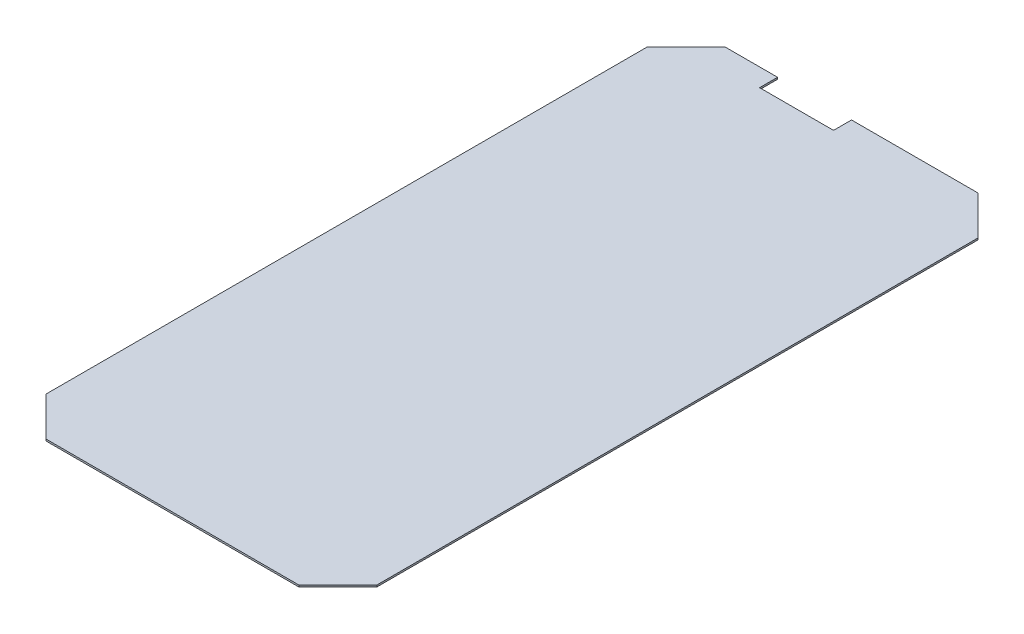
ISO-10303-21;
HEADER;
FILE_DESCRIPTION(('STEP AP214'),'2;1');
FILE_NAME('part.step','',(''),(''),'','','');
FILE_SCHEMA(('AUTOMOTIVE_DESIGN { 1 0 10303 214 1 1 1 1 }'));
ENDSEC;
DATA;
#1=APPLICATION_CONTEXT('core data for automotive mechanical design processes');
#2=APPLICATION_PROTOCOL_DEFINITION('international standard','automotive_design',2000,#1);
#3=PRODUCT_CONTEXT('',#1,'mechanical');
#4=PRODUCT('Part','Part','',(#3));
#5=PRODUCT_RELATED_PRODUCT_CATEGORY('part','',(#4));
#6=PRODUCT_DEFINITION_FORMATION('','',#4);
#7=PRODUCT_DEFINITION_CONTEXT('part definition',#1,'design');
#8=PRODUCT_DEFINITION('design','',#6,#7);
#9=PRODUCT_DEFINITION_SHAPE('','',#8);
#10=(LENGTH_UNIT() NAMED_UNIT(*) SI_UNIT(.MILLI.,.METRE.));
#11=(NAMED_UNIT(*) PLANE_ANGLE_UNIT() SI_UNIT($,.RADIAN.));
#12=(NAMED_UNIT(*) SI_UNIT($,.STERADIAN.) SOLID_ANGLE_UNIT());
#13=UNCERTAINTY_MEASURE_WITH_UNIT(LENGTH_MEASURE(1.E-05),#10,'distance_accuracy_value','');
#14=(GEOMETRIC_REPRESENTATION_CONTEXT(3) GLOBAL_UNCERTAINTY_ASSIGNED_CONTEXT((#13)) GLOBAL_UNIT_ASSIGNED_CONTEXT((#10,
#11,#12)) REPRESENTATION_CONTEXT('',''));
#15=CARTESIAN_POINT('',(0.,0.,0.));
#16=DIRECTION('',(0.,0.,1.));
#17=DIRECTION('',(1.,0.,0.));
#18=AXIS2_PLACEMENT_3D('',#15,#16,#17);
#19=CARTESIAN_POINT('',(-17.,0.18,-34.9));
#20=DIRECTION('',(0.,0.,1.));
#21=DIRECTION('',(1.,0.,0.));
#22=AXIS2_PLACEMENT_3D('',#19,#20,#21);
#23=PLANE('',#22);
#24=DIRECTION('',(-1.,0.,0.));
#25=VECTOR('',#24,1.);
#26=CARTESIAN_POINT('',(-17.,0.18,-34.9));
#27=LINE('',#26,#25);
#28=CARTESIAN_POINT('',(-7.6,0.18,-34.9));
#29=VERTEX_POINT('',#28);
#30=CARTESIAN_POINT('',(-13.,0.18,-34.9));
#31=VERTEX_POINT('',#30);
#32=EDGE_CURVE('E164',#29,#31,#27,.T.);
#33=ORIENTED_EDGE('',*,*,#32,.F.);
#34=DIRECTION('',(0.,1.,0.));
#35=VECTOR('',#34,1.);
#36=CARTESIAN_POINT('',(-7.6,0.,-34.9));
#37=LINE('',#36,#35);
#38=CARTESIAN_POINT('',(-7.6,0.,-34.9));
#39=VERTEX_POINT('',#38);
#40=EDGE_CURVE('E154',#39,#29,#37,.T.);
#41=ORIENTED_EDGE('',*,*,#40,.F.);
#42=DIRECTION('',(-1.,0.,0.));
#43=VECTOR('',#42,1.);
#44=CARTESIAN_POINT('',(-17.,0.,-34.9));
#45=LINE('',#44,#43);
#46=CARTESIAN_POINT('',(-13.,0.,-34.9));
#47=VERTEX_POINT('',#46);
#48=EDGE_CURVE('E145',#39,#47,#45,.T.);
#49=ORIENTED_EDGE('',*,*,#48,.T.);
#50=DIRECTION('',(0.,1.,0.));
#51=VECTOR('',#50,1.);
#52=CARTESIAN_POINT('',(-13.,0.18,-34.9));
#53=LINE('',#52,#51);
#54=EDGE_CURVE('E174',#47,#31,#53,.T.);
#55=ORIENTED_EDGE('',*,*,#54,.T.);
#56=EDGE_LOOP('',(#33,#41,#49,#55));
#57=FACE_BOUND('',#56,.T.);
#58=ADVANCED_FACE('F35',(#57),#23,.F.);
#59=CARTESIAN_POINT('',(17.,0.18,34.9));
#60=DIRECTION('',(-1.,0.,0.));
#61=DIRECTION('',(0.,0.,1.));
#62=AXIS2_PLACEMENT_3D('',#59,#60,#61);
#63=PLANE('',#62);
#64=DIRECTION('',(0.,0.,-1.));
#65=VECTOR('',#64,1.);
#66=CARTESIAN_POINT('',(17.,0.,34.9));
#67=LINE('',#66,#65);
#68=CARTESIAN_POINT('',(17.,0.,30.9));
#69=VERTEX_POINT('',#68);
#70=CARTESIAN_POINT('',(17.,0.,-30.9));
#71=VERTEX_POINT('',#70);
#72=EDGE_CURVE('E156',#69,#71,#67,.T.);
#73=ORIENTED_EDGE('',*,*,#72,.T.);
#74=DIRECTION('',(0.,1.,0.));
#75=VECTOR('',#74,1.);
#76=CARTESIAN_POINT('',(17.,0.18,-30.9));
#77=LINE('',#76,#75);
#78=CARTESIAN_POINT('',(17.,0.18,-30.9));
#79=VERTEX_POINT('',#78);
#80=EDGE_CURVE('E200',#71,#79,#77,.T.);
#81=ORIENTED_EDGE('',*,*,#80,.T.);
#82=DIRECTION('',(0.,0.,-1.));
#83=VECTOR('',#82,1.);
#84=CARTESIAN_POINT('',(17.,0.18,34.9));
#85=LINE('',#84,#83);
#86=CARTESIAN_POINT('',(17.,0.18,30.9));
#87=VERTEX_POINT('',#86);
#88=EDGE_CURVE('E161',#87,#79,#85,.T.);
#89=ORIENTED_EDGE('',*,*,#88,.F.);
#90=DIRECTION('',(0.,-1.,0.));
#91=VECTOR('',#90,1.);
#92=CARTESIAN_POINT('',(17.,0.18,30.9));
#93=LINE('',#92,#91);
#94=EDGE_CURVE('E197',#87,#69,#93,.T.);
#95=ORIENTED_EDGE('',*,*,#94,.T.);
#96=EDGE_LOOP('',(#73,#81,#89,#95));
#97=FACE_BOUND('',#96,.T.);
#98=ADVANCED_FACE('F228',(#97),#63,.F.);
#99=CARTESIAN_POINT('',(13.,0.,-34.9));
#100=VERTEX_POINT('',#99);
#101=CARTESIAN_POINT('',(0.,0.,-34.9));
#102=VERTEX_POINT('',#101);
#103=EDGE_CURVE('E177',#100,#102,#45,.T.);
#104=ORIENTED_EDGE('',*,*,#103,.T.);
#105=DIRECTION('',(0.,1.,0.));
#106=VECTOR('',#105,1.);
#107=CARTESIAN_POINT('',(0.,0.,-34.9));
#108=LINE('',#107,#106);
#109=CARTESIAN_POINT('',(0.,0.18,-34.9));
#110=VERTEX_POINT('',#109);
#111=EDGE_CURVE('E157',#102,#110,#108,.T.);
#112=ORIENTED_EDGE('',*,*,#111,.T.);
#113=CARTESIAN_POINT('',(13.,0.18,-34.9));
#114=VERTEX_POINT('',#113);
#115=EDGE_CURVE('E166',#114,#110,#27,.T.);
#116=ORIENTED_EDGE('',*,*,#115,.F.);
#117=DIRECTION('',(0.,-1.,0.));
#118=VECTOR('',#117,1.);
#119=CARTESIAN_POINT('',(13.,0.18,-34.9));
#120=LINE('',#119,#118);
#121=EDGE_CURVE('E186',#114,#100,#120,.T.);
#122=ORIENTED_EDGE('',*,*,#121,.T.);
#123=EDGE_LOOP('',(#104,#112,#116,#122));
#124=FACE_BOUND('',#123,.T.);
#125=ADVANCED_FACE('F239',(#124),#23,.F.);
#126=CARTESIAN_POINT('',(-17.,0.18,34.9));
#127=DIRECTION('',(1.,0.,0.));
#128=DIRECTION('',(0.,0.,-1.));
#129=AXIS2_PLACEMENT_3D('',#126,#127,#128);
#130=PLANE('',#129);
#131=DIRECTION('',(0.,0.,1.));
#132=VECTOR('',#131,1.);
#133=CARTESIAN_POINT('',(-17.,0.18,34.9));
#134=LINE('',#133,#132);
#135=CARTESIAN_POINT('',(-17.,0.18,-30.9));
#136=VERTEX_POINT('',#135);
#137=CARTESIAN_POINT('',(-17.,0.18,30.9));
#138=VERTEX_POINT('',#137);
#139=EDGE_CURVE('E169',#136,#138,#134,.T.);
#140=ORIENTED_EDGE('',*,*,#139,.F.);
#141=DIRECTION('',(0.,-1.,0.));
#142=VECTOR('',#141,1.);
#143=CARTESIAN_POINT('',(-17.,0.18,-30.9));
#144=LINE('',#143,#142);
#145=CARTESIAN_POINT('',(-17.,0.,-30.9));
#146=VERTEX_POINT('',#145);
#147=EDGE_CURVE('E212',#136,#146,#144,.T.);
#148=ORIENTED_EDGE('',*,*,#147,.T.);
#149=DIRECTION('',(0.,0.,1.));
#150=VECTOR('',#149,1.);
#151=CARTESIAN_POINT('',(-17.,0.,34.9));
#152=LINE('',#151,#150);
#153=CARTESIAN_POINT('',(-17.,0.,30.9));
#154=VERTEX_POINT('',#153);
#155=EDGE_CURVE('E180',#146,#154,#152,.T.);
#156=ORIENTED_EDGE('',*,*,#155,.T.);
#157=DIRECTION('',(0.,1.,0.));
#158=VECTOR('',#157,1.);
#159=CARTESIAN_POINT('',(-17.,0.18,30.9));
#160=LINE('',#159,#158);
#161=EDGE_CURVE('E210',#154,#138,#160,.T.);
#162=ORIENTED_EDGE('',*,*,#161,.T.);
#163=EDGE_LOOP('',(#140,#148,#156,#162));
#164=FACE_BOUND('',#163,.T.);
#165=ADVANCED_FACE('F261',(#164),#130,.F.);
#166=CARTESIAN_POINT('',(-17.,0.18,34.9));
#167=DIRECTION('',(0.,0.,-1.));
#168=DIRECTION('',(-1.,0.,0.));
#169=AXIS2_PLACEMENT_3D('',#166,#167,#168);
#170=PLANE('',#169);
#171=DIRECTION('',(1.,0.,0.));
#172=VECTOR('',#171,1.);
#173=CARTESIAN_POINT('',(-17.,0.,34.9));
#174=LINE('',#173,#172);
#175=CARTESIAN_POINT('',(-13.,0.,34.9));
#176=VERTEX_POINT('',#175);
#177=CARTESIAN_POINT('',(13.,0.,34.9));
#178=VERTEX_POINT('',#177);
#179=EDGE_CURVE('E165',#176,#178,#174,.T.);
#180=ORIENTED_EDGE('',*,*,#179,.T.);
#181=DIRECTION('',(0.,1.,0.));
#182=VECTOR('',#181,1.);
#183=CARTESIAN_POINT('',(13.,0.18,34.9));
#184=LINE('',#183,#182);
#185=CARTESIAN_POINT('',(13.,0.18,34.9));
#186=VERTEX_POINT('',#185);
#187=EDGE_CURVE('E11',#178,#186,#184,.T.);
#188=ORIENTED_EDGE('',*,*,#187,.T.);
#189=DIRECTION('',(1.,0.,0.));
#190=VECTOR('',#189,1.);
#191=CARTESIAN_POINT('',(-17.,0.18,34.9));
#192=LINE('',#191,#190);
#193=CARTESIAN_POINT('',(-13.,0.18,34.9));
#194=VERTEX_POINT('',#193);
#195=EDGE_CURVE('E172',#194,#186,#192,.T.);
#196=ORIENTED_EDGE('',*,*,#195,.F.);
#197=DIRECTION('',(0.,-1.,0.));
#198=VECTOR('',#197,1.);
#199=CARTESIAN_POINT('',(-13.,0.18,34.9));
#200=LINE('',#199,#198);
#201=EDGE_CURVE('E44',#194,#176,#200,.T.);
#202=ORIENTED_EDGE('',*,*,#201,.T.);
#203=EDGE_LOOP('',(#180,#188,#196,#202));
#204=FACE_BOUND('',#203,.T.);
#205=ADVANCED_FACE('F217',(#204),#170,.F.);
#206=CARTESIAN_POINT('',(0.,0.18,0.));
#207=DIRECTION('',(0.,-1.,0.));
#208=DIRECTION('',(0.,0.,-1.));
#209=AXIS2_PLACEMENT_3D('',#206,#207,#208);
#210=PLANE('',#209);
#211=DIRECTION('',(1.,0.,0.));
#212=VECTOR('',#211,1.);
#213=CARTESIAN_POINT('',(-7.59999999999999,0.18,-33.05));
#214=LINE('',#213,#212);
#215=CARTESIAN_POINT('',(-7.59999999999999,0.18,-33.05));
#216=VERTEX_POINT('',#215);
#217=CARTESIAN_POINT('',(0.,0.18,-33.05));
#218=VERTEX_POINT('',#217);
#219=EDGE_CURVE('E148',#216,#218,#214,.T.);
#220=ORIENTED_EDGE('',*,*,#219,.F.);
#221=DIRECTION('',(0.,0.,1.));
#222=VECTOR('',#221,1.);
#223=CARTESIAN_POINT('',(-7.6,0.18,-34.9));
#224=LINE('',#223,#222);
#225=EDGE_CURVE('E131',#29,#216,#224,.T.);
#226=ORIENTED_EDGE('',*,*,#225,.F.);
#227=ORIENTED_EDGE('',*,*,#32,.T.);
#228=DIRECTION('',(0.707106781186548,0.,-0.707106781186547));
#229=VECTOR('',#228,1.);
#230=CARTESIAN_POINT('',(-17.,0.18,-30.9));
#231=LINE('',#230,#229);
#232=EDGE_CURVE('E206',#31,#136,#231,.F.);
#233=ORIENTED_EDGE('',*,*,#232,.T.);
#234=ORIENTED_EDGE('',*,*,#139,.T.);
#235=DIRECTION('',(-0.707106781186546,0.,-0.707106781186549));
#236=VECTOR('',#235,1.);
#237=CARTESIAN_POINT('',(-13.,0.18,34.9));
#238=LINE('',#237,#236);
#239=EDGE_CURVE('E202',#138,#194,#238,.F.);
#240=ORIENTED_EDGE('',*,*,#239,.T.);
#241=ORIENTED_EDGE('',*,*,#195,.T.);
#242=DIRECTION('',(-0.707106781186549,0.,0.707106781186546));
#243=VECTOR('',#242,1.);
#244=CARTESIAN_POINT('',(17.,0.18,30.9));
#245=LINE('',#244,#243);
#246=EDGE_CURVE('E204',#186,#87,#245,.F.);
#247=ORIENTED_EDGE('',*,*,#246,.T.);
#248=ORIENTED_EDGE('',*,*,#88,.T.);
#249=DIRECTION('',(0.707106781186546,0.,0.707106781186549));
#250=VECTOR('',#249,1.);
#251=CARTESIAN_POINT('',(13.,0.18,-34.9));
#252=LINE('',#251,#250);
#253=EDGE_CURVE('E208',#79,#114,#252,.F.);
#254=ORIENTED_EDGE('',*,*,#253,.T.);
#255=ORIENTED_EDGE('',*,*,#115,.T.);
#256=DIRECTION('',(0.,0.,-1.));
#257=VECTOR('',#256,1.);
#258=CARTESIAN_POINT('',(0.,0.18,-34.9));
#259=LINE('',#258,#257);
#260=EDGE_CURVE('E146',#218,#110,#259,.T.);
#261=ORIENTED_EDGE('',*,*,#260,.F.);
#262=EDGE_LOOP('',(#220,#226,#227,#233,#234,#240,#241,#247,#248,#254,#255,#261));
#263=FACE_BOUND('',#262,.T.);
#264=ADVANCED_FACE('F232',(#263),#210,.F.);
#265=CARTESIAN_POINT('',(0.,0.,0.));
#266=DIRECTION('',(0.,-1.,0.));
#267=DIRECTION('',(0.,0.,-1.));
#268=AXIS2_PLACEMENT_3D('',#265,#266,#267);
#269=PLANE('',#268);
#270=DIRECTION('',(0.,0.,1.));
#271=VECTOR('',#270,1.);
#272=CARTESIAN_POINT('',(-7.6,0.,-34.9));
#273=LINE('',#272,#271);
#274=CARTESIAN_POINT('',(-7.59999999999999,0.,-33.05));
#275=VERTEX_POINT('',#274);
#276=EDGE_CURVE('E128',#39,#275,#273,.T.);
#277=ORIENTED_EDGE('',*,*,#276,.T.);
#278=DIRECTION('',(1.,0.,0.));
#279=VECTOR('',#278,1.);
#280=CARTESIAN_POINT('',(-7.59999999999999,0.,-33.05));
#281=LINE('',#280,#279);
#282=CARTESIAN_POINT('',(0.,0.,-33.05));
#283=VERTEX_POINT('',#282);
#284=EDGE_CURVE('E138',#275,#283,#281,.T.);
#285=ORIENTED_EDGE('',*,*,#284,.T.);
#286=DIRECTION('',(0.,0.,-1.));
#287=VECTOR('',#286,1.);
#288=CARTESIAN_POINT('',(0.,0.,-34.9));
#289=LINE('',#288,#287);
#290=EDGE_CURVE('E51',#283,#102,#289,.T.);
#291=ORIENTED_EDGE('',*,*,#290,.T.);
#292=ORIENTED_EDGE('',*,*,#103,.F.);
#293=DIRECTION('',(-0.707106781186546,0.,-0.707106781186549));
#294=VECTOR('',#293,1.);
#295=CARTESIAN_POINT('',(23.95,0.,-23.9499999999999));
#296=LINE('',#295,#294);
#297=EDGE_CURVE('E195',#100,#71,#296,.F.);
#298=ORIENTED_EDGE('',*,*,#297,.T.);
#299=ORIENTED_EDGE('',*,*,#72,.F.);
#300=DIRECTION('',(0.707106781186549,0.,-0.707106781186546));
#301=VECTOR('',#300,1.);
#302=CARTESIAN_POINT('',(23.95,0.,23.9500000000001));
#303=LINE('',#302,#301);
#304=EDGE_CURVE('E191',#69,#178,#303,.F.);
#305=ORIENTED_EDGE('',*,*,#304,.T.);
#306=ORIENTED_EDGE('',*,*,#179,.F.);
#307=DIRECTION('',(0.707106781186546,0.,0.707106781186549));
#308=VECTOR('',#307,1.);
#309=CARTESIAN_POINT('',(-23.95,0.,23.9499999999999));
#310=LINE('',#309,#308);
#311=EDGE_CURVE('E189',#176,#154,#310,.F.);
#312=ORIENTED_EDGE('',*,*,#311,.T.);
#313=ORIENTED_EDGE('',*,*,#155,.F.);
#314=DIRECTION('',(-0.707106781186548,0.,0.707106781186547));
#315=VECTOR('',#314,1.);
#316=CARTESIAN_POINT('',(-23.95,0.,-23.95));
#317=LINE('',#316,#315);
#318=EDGE_CURVE('E193',#146,#47,#317,.F.);
#319=ORIENTED_EDGE('',*,*,#318,.T.);
#320=ORIENTED_EDGE('',*,*,#48,.F.);
#321=EDGE_LOOP('',(#277,#285,#291,#292,#298,#299,#305,#306,#312,#313,#319,#320));
#322=FACE_BOUND('',#321,.T.);
#323=ADVANCED_FACE('F143',(#322),#269,.T.);
#324=CARTESIAN_POINT('',(13.,0.18,-34.9));
#325=DIRECTION('',(-0.707106781186549,0.,0.707106781186546));
#326=DIRECTION('',(0.,-1.,0.));
#327=AXIS2_PLACEMENT_3D('',#324,#325,#326);
#328=PLANE('',#327);
#329=ORIENTED_EDGE('',*,*,#253,.F.);
#330=ORIENTED_EDGE('',*,*,#80,.F.);
#331=ORIENTED_EDGE('',*,*,#297,.F.);
#332=ORIENTED_EDGE('',*,*,#121,.F.);
#333=EDGE_LOOP('',(#329,#330,#331,#332));
#334=FACE_BOUND('',#333,.T.);
#335=ADVANCED_FACE('F236',(#334),#328,.F.);
#336=CARTESIAN_POINT('',(-17.,0.18,-30.9));
#337=DIRECTION('',(0.707106781186547,0.,0.707106781186548));
#338=DIRECTION('',(0.,-1.,0.));
#339=AXIS2_PLACEMENT_3D('',#336,#337,#338);
#340=PLANE('',#339);
#341=ORIENTED_EDGE('',*,*,#232,.F.);
#342=ORIENTED_EDGE('',*,*,#54,.F.);
#343=ORIENTED_EDGE('',*,*,#318,.F.);
#344=ORIENTED_EDGE('',*,*,#147,.F.);
#345=EDGE_LOOP('',(#341,#342,#343,#344));
#346=FACE_BOUND('',#345,.T.);
#347=ADVANCED_FACE('F312',(#346),#340,.F.);
#348=CARTESIAN_POINT('',(17.,0.18,30.9));
#349=DIRECTION('',(-0.707106781186546,0.,-0.707106781186549));
#350=DIRECTION('',(0.,-1.,0.));
#351=AXIS2_PLACEMENT_3D('',#348,#349,#350);
#352=PLANE('',#351);
#353=ORIENTED_EDGE('',*,*,#246,.F.);
#354=ORIENTED_EDGE('',*,*,#187,.F.);
#355=ORIENTED_EDGE('',*,*,#304,.F.);
#356=ORIENTED_EDGE('',*,*,#94,.F.);
#357=EDGE_LOOP('',(#353,#354,#355,#356));
#358=FACE_BOUND('',#357,.T.);
#359=ADVANCED_FACE('F225',(#358),#352,.F.);
#360=CARTESIAN_POINT('',(-13.,0.18,34.9));
#361=DIRECTION('',(0.707106781186549,0.,-0.707106781186546));
#362=DIRECTION('',(0.,-1.,0.));
#363=AXIS2_PLACEMENT_3D('',#360,#361,#362);
#364=PLANE('',#363);
#365=ORIENTED_EDGE('',*,*,#239,.F.);
#366=ORIENTED_EDGE('',*,*,#161,.F.);
#367=ORIENTED_EDGE('',*,*,#311,.F.);
#368=ORIENTED_EDGE('',*,*,#201,.F.);
#369=EDGE_LOOP('',(#365,#366,#367,#368));
#370=FACE_BOUND('',#369,.T.);
#371=ADVANCED_FACE('F38',(#370),#364,.F.);
#372=CARTESIAN_POINT('',(-7.6,0.,-34.9));
#373=DIRECTION('',(-1.,0.,0.));
#374=DIRECTION('',(0.,0.,1.));
#375=AXIS2_PLACEMENT_3D('',#372,#373,#374);
#376=PLANE('',#375);
#377=ORIENTED_EDGE('',*,*,#225,.T.);
#378=DIRECTION('',(0.,1.,0.));
#379=VECTOR('',#378,1.);
#380=CARTESIAN_POINT('',(-7.59999999999999,0.,-33.05));
#381=LINE('',#380,#379);
#382=EDGE_CURVE('E124',#275,#216,#381,.T.);
#383=ORIENTED_EDGE('',*,*,#382,.F.);
#384=ORIENTED_EDGE('',*,*,#276,.F.);
#385=ORIENTED_EDGE('',*,*,#40,.T.);
#386=EDGE_LOOP('',(#377,#383,#384,#385));
#387=FACE_BOUND('',#386,.T.);
#388=ADVANCED_FACE('F126',(#387),#376,.F.);
#389=CARTESIAN_POINT('',(0.,0.,-34.9));
#390=DIRECTION('',(1.,0.,0.));
#391=DIRECTION('',(0.,0.,-1.));
#392=AXIS2_PLACEMENT_3D('',#389,#390,#391);
#393=PLANE('',#392);
#394=ORIENTED_EDGE('',*,*,#260,.T.);
#395=ORIENTED_EDGE('',*,*,#111,.F.);
#396=ORIENTED_EDGE('',*,*,#290,.F.);
#397=DIRECTION('',(0.,1.,0.));
#398=VECTOR('',#397,1.);
#399=CARTESIAN_POINT('',(0.,0.,-33.05));
#400=LINE('',#399,#398);
#401=EDGE_CURVE('E135',#283,#218,#400,.T.);
#402=ORIENTED_EDGE('',*,*,#401,.T.);
#403=EDGE_LOOP('',(#394,#395,#396,#402));
#404=FACE_BOUND('',#403,.T.);
#405=ADVANCED_FACE('F241',(#404),#393,.F.);
#406=CARTESIAN_POINT('',(-7.59999999999999,0.,-33.05));
#407=DIRECTION('',(0.,0.,1.));
#408=DIRECTION('',(1.,0.,0.));
#409=AXIS2_PLACEMENT_3D('',#406,#407,#408);
#410=PLANE('',#409);
#411=ORIENTED_EDGE('',*,*,#219,.T.);
#412=ORIENTED_EDGE('',*,*,#401,.F.);
#413=ORIENTED_EDGE('',*,*,#284,.F.);
#414=ORIENTED_EDGE('',*,*,#382,.T.);
#415=EDGE_LOOP('',(#411,#412,#413,#414));
#416=FACE_BOUND('',#415,.T.);
#417=ADVANCED_FACE('F139',(#416),#410,.F.);
#418=CLOSED_SHELL('',(#58,#98,#125,#165,#205,#264,#323,#335,#347,#359,#371,#388,#405,#417));
#419=MANIFOLD_SOLID_BREP('B2',#418);
#420=ADVANCED_BREP_SHAPE_REPRESENTATION('',(#18,#419),#14);
#421=SHAPE_DEFINITION_REPRESENTATION(#9,#420);
ENDSEC;
END-ISO-10303-21;
